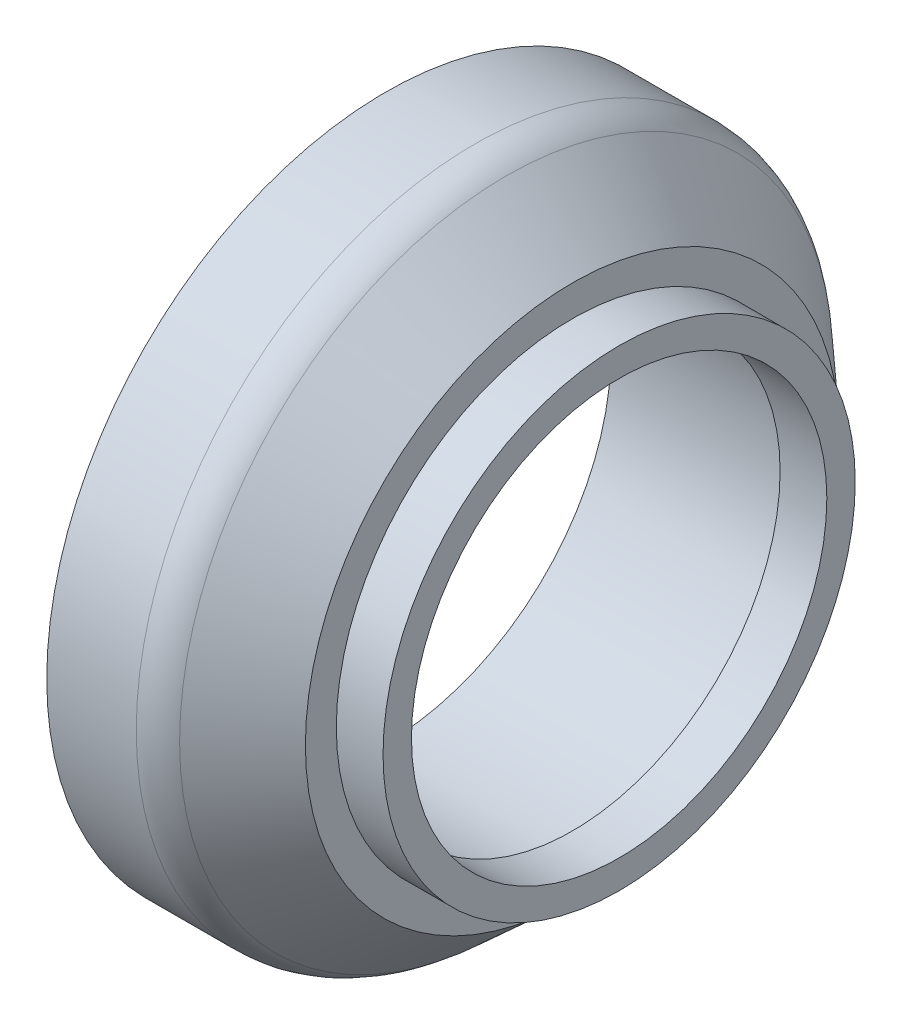
ISO-10303-21;
HEADER;
FILE_DESCRIPTION(('STEP AP214'),'2;1');
FILE_NAME('part.step','',(''),(''),'','','');
FILE_SCHEMA(('AUTOMOTIVE_DESIGN { 1 0 10303 214 1 1 1 1 }'));
ENDSEC;
DATA;
#1=APPLICATION_CONTEXT('core data for automotive mechanical design processes');
#2=APPLICATION_PROTOCOL_DEFINITION('international standard','automotive_design',2000,#1);
#3=PRODUCT_CONTEXT('',#1,'mechanical');
#4=PRODUCT('Part','Part','',(#3));
#5=PRODUCT_RELATED_PRODUCT_CATEGORY('part','',(#4));
#6=PRODUCT_DEFINITION_FORMATION('','',#4);
#7=PRODUCT_DEFINITION_CONTEXT('part definition',#1,'design');
#8=PRODUCT_DEFINITION('design','',#6,#7);
#9=PRODUCT_DEFINITION_SHAPE('','',#8);
#10=(LENGTH_UNIT() NAMED_UNIT(*) SI_UNIT(.MILLI.,.METRE.));
#11=(NAMED_UNIT(*) PLANE_ANGLE_UNIT() SI_UNIT($,.RADIAN.));
#12=(NAMED_UNIT(*) SI_UNIT($,.STERADIAN.) SOLID_ANGLE_UNIT());
#13=UNCERTAINTY_MEASURE_WITH_UNIT(LENGTH_MEASURE(1.E-05),#10,'distance_accuracy_value','');
#14=(GEOMETRIC_REPRESENTATION_CONTEXT(3) GLOBAL_UNCERTAINTY_ASSIGNED_CONTEXT((#13)) GLOBAL_UNIT_ASSIGNED_CONTEXT((#10,
#11,#12)) REPRESENTATION_CONTEXT('',''));
#15=CARTESIAN_POINT('',(0.,0.,0.));
#16=DIRECTION('',(0.,0.,1.));
#17=DIRECTION('',(1.,0.,0.));
#18=AXIS2_PLACEMENT_3D('',#15,#16,#17);
#19=CARTESIAN_POINT('',(0.,72.5,0.));
#20=DIRECTION('',(1.,0.,0.));
#21=DIRECTION('',(0.,0.,-1.));
#22=AXIS2_PLACEMENT_3D('',#19,#20,#21);
#23=PLANE('',#22);
#24=CARTESIAN_POINT('',(0.,53.2469218721899,-32.726370271341));
#25=DIRECTION('',(1.,0.,0.));
#26=DIRECTION('',(0.,0.,-1.));
#27=AXIS2_PLACEMENT_3D('',#24,#25,#26);
#28=CIRCLE('',#27,6.35000000000003);
#29=CARTESIAN_POINT('',(0.,53.2469218721899,-39.076370271341));
#30=VERTEX_POINT('',#29);
#31=EDGE_CURVE('E10',#30,#30,#28,.T.);
#32=ORIENTED_EDGE('',*,*,#31,.T.);
#33=EDGE_LOOP('',(#32));
#34=FACE_BOUND('',#33,.T.);
#35=CARTESIAN_POINT('',(0.,29.7500018789712,-54.9653289647321));
#36=DIRECTION('',(1.,0.,0.));
#37=DIRECTION('',(0.,0.,-1.));
#38=AXIS2_PLACEMENT_3D('',#35,#36,#37);
#39=CIRCLE('',#38,6.35000000000001);
#40=CARTESIAN_POINT('',(0.,29.7500018789712,-61.3153289647321));
#41=VERTEX_POINT('',#40);
#42=EDGE_CURVE('E45',#41,#41,#39,.T.);
#43=ORIENTED_EDGE('',*,*,#42,.T.);
#44=EDGE_LOOP('',(#43));
#45=FACE_BOUND('',#44,.T.);
#46=CARTESIAN_POINT('',(0.,-1.71840709254231,-62.4763721503122));
#47=DIRECTION('',(1.,0.,0.));
#48=DIRECTION('',(0.,0.,-1.));
#49=AXIS2_PLACEMENT_3D('',#46,#47,#48);
#50=CIRCLE('',#49,6.35000000000002);
#51=CARTESIAN_POINT('',(0.,-1.71840709254231,-68.8263721503122));
#52=VERTEX_POINT('',#51);
#53=EDGE_CURVE('E54',#52,#52,#50,.T.);
#54=ORIENTED_EDGE('',*,*,#53,.T.);
#55=EDGE_LOOP('',(#54));
#56=FACE_BOUND('',#55,.T.);
#57=CARTESIAN_POINT('',(0.,-32.7263702713411,-53.2469218721898));
#58=DIRECTION('',(1.,0.,0.));
#59=DIRECTION('',(0.,0.,-1.));
#60=AXIS2_PLACEMENT_3D('',#57,#58,#59);
#61=CIRCLE('',#60,6.34999999999996);
#62=CARTESIAN_POINT('',(0.,-32.7263702713411,-59.5969218721897));
#63=VERTEX_POINT('',#62);
#64=EDGE_CURVE('E60',#63,#63,#61,.T.);
#65=ORIENTED_EDGE('',*,*,#64,.T.);
#66=EDGE_LOOP('',(#65));
#67=FACE_BOUND('',#66,.T.);
#68=CARTESIAN_POINT('',(0.,-54.9653289647322,-29.750001878971));
#69=DIRECTION('',(1.,0.,0.));
#70=DIRECTION('',(0.,0.,-1.));
#71=AXIS2_PLACEMENT_3D('',#68,#69,#70);
#72=CIRCLE('',#71,6.35);
#73=CARTESIAN_POINT('',(0.,-54.9653289647322,-36.100001878971));
#74=VERTEX_POINT('',#73);
#75=EDGE_CURVE('E66',#74,#74,#72,.T.);
#76=ORIENTED_EDGE('',*,*,#75,.T.);
#77=EDGE_LOOP('',(#76));
#78=FACE_BOUND('',#77,.T.);
#79=CARTESIAN_POINT('',(0.,-62.4763721503121,1.71840709254296));
#80=DIRECTION('',(1.,0.,0.));
#81=DIRECTION('',(0.,0.,-1.));
#82=AXIS2_PLACEMENT_3D('',#79,#80,#81);
#83=CIRCLE('',#82,6.35000000000005);
#84=CARTESIAN_POINT('',(0.,-62.4763721503121,-4.63159290745709));
#85=VERTEX_POINT('',#84);
#86=EDGE_CURVE('E72',#85,#85,#83,.T.);
#87=ORIENTED_EDGE('',*,*,#86,.T.);
#88=EDGE_LOOP('',(#87));
#89=FACE_BOUND('',#88,.T.);
#90=CARTESIAN_POINT('',(0.,-53.2469218721896,32.7263702713413));
#91=DIRECTION('',(1.,0.,0.));
#92=DIRECTION('',(0.,0.,-1.));
#93=AXIS2_PLACEMENT_3D('',#90,#91,#92);
#94=CIRCLE('',#93,6.35000000000008);
#95=CARTESIAN_POINT('',(0.,-53.2469218721896,26.3763702713413));
#96=VERTEX_POINT('',#95);
#97=EDGE_CURVE('E78',#96,#96,#94,.T.);
#98=ORIENTED_EDGE('',*,*,#97,.T.);
#99=EDGE_LOOP('',(#98));
#100=FACE_BOUND('',#99,.T.);
#101=CARTESIAN_POINT('',(0.,-29.7500018789708,54.9653289647323));
#102=DIRECTION('',(1.,0.,0.));
#103=DIRECTION('',(0.,0.,-1.));
#104=AXIS2_PLACEMENT_3D('',#101,#102,#103);
#105=CIRCLE('',#104,6.34999999999998);
#106=CARTESIAN_POINT('',(0.,-29.7500018789708,48.6153289647323));
#107=VERTEX_POINT('',#106);
#108=EDGE_CURVE('E84',#107,#107,#105,.T.);
#109=ORIENTED_EDGE('',*,*,#108,.T.);
#110=EDGE_LOOP('',(#109));
#111=FACE_BOUND('',#110,.T.);
#112=CARTESIAN_POINT('',(0.,1.71840709254274,62.4763721503122));
#113=DIRECTION('',(1.,0.,0.));
#114=DIRECTION('',(0.,0.,-1.));
#115=AXIS2_PLACEMENT_3D('',#112,#113,#114);
#116=CIRCLE('',#115,6.35000000000002);
#117=CARTESIAN_POINT('',(0.,1.71840709254274,56.1263721503121));
#118=VERTEX_POINT('',#117);
#119=EDGE_CURVE('E90',#118,#118,#116,.T.);
#120=ORIENTED_EDGE('',*,*,#119,.T.);
#121=EDGE_LOOP('',(#120));
#122=FACE_BOUND('',#121,.T.);
#123=CARTESIAN_POINT('',(0.,32.7263702713415,53.2469218721895));
#124=DIRECTION('',(1.,0.,0.));
#125=DIRECTION('',(0.,0.,-1.));
#126=AXIS2_PLACEMENT_3D('',#123,#124,#125);
#127=CIRCLE('',#126,6.35000000000007);
#128=CARTESIAN_POINT('',(0.,32.7263702713415,46.8969218721895));
#129=VERTEX_POINT('',#128);
#130=EDGE_CURVE('E96',#129,#129,#127,.T.);
#131=ORIENTED_EDGE('',*,*,#130,.T.);
#132=EDGE_LOOP('',(#131));
#133=FACE_BOUND('',#132,.T.);
#134=CARTESIAN_POINT('',(0.,54.9653289647324,29.7500018789706));
#135=DIRECTION('',(1.,0.,0.));
#136=DIRECTION('',(0.,0.,-1.));
#137=AXIS2_PLACEMENT_3D('',#134,#135,#136);
#138=CIRCLE('',#137,6.35000000000004);
#139=CARTESIAN_POINT('',(0.,54.9653289647324,23.4000018789705));
#140=VERTEX_POINT('',#139);
#141=EDGE_CURVE('E102',#140,#140,#138,.T.);
#142=ORIENTED_EDGE('',*,*,#141,.T.);
#143=EDGE_LOOP('',(#142));
#144=FACE_BOUND('',#143,.T.);
#145=CARTESIAN_POINT('',(0.,62.4763721503121,-1.71840709254296));
#146=DIRECTION('',(1.,0.,0.));
#147=DIRECTION('',(0.,0.,-1.));
#148=AXIS2_PLACEMENT_3D('',#145,#146,#147);
#149=CIRCLE('',#148,6.35000000000005);
#150=CARTESIAN_POINT('',(0.,62.4763721503121,-8.06840709254301));
#151=VERTEX_POINT('',#150);
#152=EDGE_CURVE('E108',#151,#151,#149,.T.);
#153=ORIENTED_EDGE('',*,*,#152,.T.);
#154=EDGE_LOOP('',(#153));
#155=FACE_BOUND('',#154,.T.);
#156=CARTESIAN_POINT('',(0.,0.,0.));
#157=DIRECTION('',(-1.,0.,0.));
#158=DIRECTION('',(0.,0.,1.));
#159=AXIS2_PLACEMENT_3D('',#156,#157,#158);
#160=CIRCLE('',#159,48.25);
#161=CARTESIAN_POINT('',(0.,0.,48.25));
#162=VERTEX_POINT('',#161);
#163=EDGE_CURVE('E123',#162,#162,#160,.T.);
#164=ORIENTED_EDGE('',*,*,#163,.F.);
#165=EDGE_LOOP('',(#164));
#166=FACE_BOUND('',#165,.T.);
#167=CARTESIAN_POINT('',(0.,0.,0.));
#168=DIRECTION('',(-1.,0.,0.));
#169=DIRECTION('',(0.,0.,1.));
#170=AXIS2_PLACEMENT_3D('',#167,#168,#169);
#171=CIRCLE('',#170,72.5);
#172=CARTESIAN_POINT('',(0.,0.,72.5));
#173=VERTEX_POINT('',#172);
#174=EDGE_CURVE('E132',#173,#173,#171,.T.);
#175=ORIENTED_EDGE('',*,*,#174,.T.);
#176=EDGE_LOOP('',(#175));
#177=FACE_BOUND('',#176,.T.);
#178=ADVANCED_FACE('F34',(#34,#45,#56,#67,#78,#89,#100,#111,#122,#133,#144,#155,#166,#177),#23,.F.);
#179=CARTESIAN_POINT('',(0.,0.,0.));
#180=DIRECTION('',(-1.,0.,0.));
#181=DIRECTION('',(0.,0.,1.));
#182=AXIS2_PLACEMENT_3D('',#179,#180,#181);
#183=CYLINDRICAL_SURFACE('',#182,48.25);
#184=CARTESIAN_POINT('',(40.,0.,0.));
#185=DIRECTION('',(-1.,0.,0.));
#186=DIRECTION('',(0.,0.,1.));
#187=AXIS2_PLACEMENT_3D('',#184,#185,#186);
#188=CIRCLE('',#187,48.25);
#189=CARTESIAN_POINT('',(40.,0.,48.25));
#190=VERTEX_POINT('',#189);
#191=EDGE_CURVE('E126',#190,#190,#188,.T.);
#192=ORIENTED_EDGE('',*,*,#191,.F.);
#193=EDGE_LOOP('',(#192));
#194=FACE_BOUND('',#193,.T.);
#195=ORIENTED_EDGE('',*,*,#163,.T.);
#196=EDGE_LOOP('',(#195));
#197=FACE_BOUND('',#196,.T.);
#198=ADVANCED_FACE('F198',(#194,#197),#183,.F.);
#199=CARTESIAN_POINT('',(40.,48.25,0.));
#200=DIRECTION('',(-1.,0.,0.));
#201=DIRECTION('',(0.,0.,1.));
#202=AXIS2_PLACEMENT_3D('',#199,#200,#201);
#203=PLANE('',#202);
#204=CARTESIAN_POINT('',(40.,0.,0.));
#205=DIRECTION('',(-1.,0.,0.));
#206=DIRECTION('',(0.,0.,1.));
#207=AXIS2_PLACEMENT_3D('',#204,#205,#206);
#208=CIRCLE('',#207,50.53);
#209=CARTESIAN_POINT('',(40.,0.,50.53));
#210=VERTEX_POINT('',#209);
#211=EDGE_CURVE('E114',#210,#210,#208,.F.);
#212=ORIENTED_EDGE('',*,*,#211,.F.);
#213=EDGE_LOOP('',(#212));
#214=FACE_BOUND('',#213,.T.);
#215=CARTESIAN_POINT('',(40.,0.,0.));
#216=DIRECTION('',(-1.,0.,0.));
#217=DIRECTION('',(0.,0.,1.));
#218=AXIS2_PLACEMENT_3D('',#215,#216,#217);
#219=CIRCLE('',#218,57.15);
#220=CARTESIAN_POINT('',(40.,0.,57.15));
#221=VERTEX_POINT('',#220);
#222=EDGE_CURVE('E129',#221,#221,#219,.T.);
#223=ORIENTED_EDGE('',*,*,#222,.F.);
#224=EDGE_LOOP('',(#223));
#225=FACE_BOUND('',#224,.T.);
#226=ADVANCED_FACE('F203',(#214,#225),#203,.F.);
#227=CARTESIAN_POINT('',(40.,0.,0.));
#228=DIRECTION('',(-1.,0.,0.));
#229=DIRECTION('',(0.,0.,1.));
#230=AXIS2_PLACEMENT_3D('',#227,#228,#229);
#231=CONICAL_SURFACE('',#230,57.15,0.73443768676526);
#232=CARTESIAN_POINT('',(25.8550285509689,0.,0.));
#233=DIRECTION('',(1.,0.,0.));
#234=DIRECTION('',(0.,0.,-1.));
#235=AXIS2_PLACEMENT_3D('',#232,#233,#234);
#236=CIRCLE('',#235,69.922077161331);
#237=CARTESIAN_POINT('',(25.8550285509689,0.,-69.922077161331));
#238=VERTEX_POINT('',#237);
#239=EDGE_CURVE('E117',#238,#238,#236,.T.);
#240=ORIENTED_EDGE('',*,*,#239,.T.);
#241=EDGE_LOOP('',(#240));
#242=FACE_BOUND('',#241,.T.);
#243=ORIENTED_EDGE('',*,*,#222,.T.);
#244=EDGE_LOOP('',(#243));
#245=FACE_BOUND('',#244,.T.);
#246=ADVANCED_FACE('F293',(#242,#245),#231,.T.);
#247=CARTESIAN_POINT('',(0.,0.,0.));
#248=DIRECTION('',(-1.,0.,0.));
#249=DIRECTION('',(0.,0.,1.));
#250=AXIS2_PLACEMENT_3D('',#247,#248,#249);
#251=CYLINDRICAL_SURFACE('',#250,72.5);
#252=CARTESIAN_POINT('',(19.1533294670613,0.,0.));
#253=DIRECTION('',(1.,0.,0.));
#254=DIRECTION('',(0.,0.,-1.));
#255=AXIS2_PLACEMENT_3D('',#252,#253,#254);
#256=CIRCLE('',#255,72.5);
#257=CARTESIAN_POINT('',(19.1533294670613,0.,-72.5));
#258=VERTEX_POINT('',#257);
#259=EDGE_CURVE('E120',#258,#258,#256,.F.);
#260=ORIENTED_EDGE('',*,*,#259,.T.);
#261=EDGE_LOOP('',(#260));
#262=FACE_BOUND('',#261,.T.);
#263=ORIENTED_EDGE('',*,*,#174,.F.);
#264=EDGE_LOOP('',(#263));
#265=FACE_BOUND('',#264,.T.);
#266=ADVANCED_FACE('F213',(#262,#265),#251,.T.);
#267=CARTESIAN_POINT('',(19.1533294670613,0.,0.));
#268=DIRECTION('',(1.,0.,0.));
#269=DIRECTION('',(0.,0.,-1.));
#270=AXIS2_PLACEMENT_3D('',#267,#268,#269);
#271=TOROIDAL_SURFACE('',#270,62.5,10.);
#272=ORIENTED_EDGE('',*,*,#239,.F.);
#273=EDGE_LOOP('',(#272));
#274=FACE_BOUND('',#273,.T.);
#275=ORIENTED_EDGE('',*,*,#259,.F.);
#276=EDGE_LOOP('',(#275));
#277=FACE_BOUND('',#276,.T.);
#278=ADVANCED_FACE('F209',(#274,#277),#271,.T.);
#279=CARTESIAN_POINT('',(40.,0.,0.));
#280=DIRECTION('',(1.,0.,0.));
#281=DIRECTION('',(0.,0.,-1.));
#282=AXIS2_PLACEMENT_3D('',#279,#280,#281);
#283=PLANE('',#282);
#284=CARTESIAN_POINT('',(40.,0.,0.));
#285=DIRECTION('',(1.,0.,0.));
#286=DIRECTION('',(0.,0.,-1.));
#287=AXIS2_PLACEMENT_3D('',#284,#285,#286);
#288=CIRCLE('',#287,44.45);
#289=CARTESIAN_POINT('',(40.,0.,-44.45));
#290=VERTEX_POINT('',#289);
#291=EDGE_CURVE('E139',#290,#290,#288,.T.);
#292=ORIENTED_EDGE('',*,*,#291,.T.);
#293=EDGE_LOOP('',(#292));
#294=FACE_BOUND('',#293,.T.);
#295=ORIENTED_EDGE('',*,*,#191,.T.);
#296=EDGE_LOOP('',(#295));
#297=FACE_BOUND('',#296,.T.);
#298=ADVANCED_FACE('F212',(#294,#297),#283,.F.);
#299=CARTESIAN_POINT('',(50.,0.,0.));
#300=DIRECTION('',(1.,0.,0.));
#301=DIRECTION('',(0.,0.,-1.));
#302=AXIS2_PLACEMENT_3D('',#299,#300,#301);
#303=PLANE('',#302);
#304=CARTESIAN_POINT('',(50.,0.,0.));
#305=DIRECTION('',(1.,0.,0.));
#306=DIRECTION('',(0.,0.,-1.));
#307=AXIS2_PLACEMENT_3D('',#304,#305,#306);
#308=CIRCLE('',#307,50.53);
#309=CARTESIAN_POINT('',(50.,0.,-50.53));
#310=VERTEX_POINT('',#309);
#311=EDGE_CURVE('E135',#310,#310,#308,.T.);
#312=ORIENTED_EDGE('',*,*,#311,.T.);
#313=EDGE_LOOP('',(#312));
#314=FACE_BOUND('',#313,.T.);
#315=CARTESIAN_POINT('',(50.,0.,0.));
#316=DIRECTION('',(1.,0.,0.));
#317=DIRECTION('',(0.,0.,-1.));
#318=AXIS2_PLACEMENT_3D('',#315,#316,#317);
#319=CIRCLE('',#318,44.45);
#320=CARTESIAN_POINT('',(50.,0.,-44.45));
#321=VERTEX_POINT('',#320);
#322=EDGE_CURVE('E138',#321,#321,#319,.T.);
#323=ORIENTED_EDGE('',*,*,#322,.F.);
#324=EDGE_LOOP('',(#323));
#325=FACE_BOUND('',#324,.T.);
#326=ADVANCED_FACE('F315',(#314,#325),#303,.T.);
#327=CARTESIAN_POINT('',(50.,0.,0.));
#328=DIRECTION('',(-1.,0.,0.));
#329=DIRECTION('',(0.,0.,1.));
#330=AXIS2_PLACEMENT_3D('',#327,#328,#329);
#331=CYLINDRICAL_SURFACE('',#330,50.53);
#332=ORIENTED_EDGE('',*,*,#311,.F.);
#333=EDGE_LOOP('',(#332));
#334=FACE_BOUND('',#333,.T.);
#335=ORIENTED_EDGE('',*,*,#211,.T.);
#336=EDGE_LOOP('',(#335));
#337=FACE_BOUND('',#336,.T.);
#338=ADVANCED_FACE('F302',(#334,#337),#331,.T.);
#339=CARTESIAN_POINT('',(50.,0.,0.));
#340=DIRECTION('',(-1.,0.,0.));
#341=DIRECTION('',(0.,0.,1.));
#342=AXIS2_PLACEMENT_3D('',#339,#340,#341);
#343=CYLINDRICAL_SURFACE('',#342,44.45);
#344=ORIENTED_EDGE('',*,*,#322,.T.);
#345=EDGE_LOOP('',(#344));
#346=FACE_BOUND('',#345,.T.);
#347=ORIENTED_EDGE('',*,*,#291,.F.);
#348=EDGE_LOOP('',(#347));
#349=FACE_BOUND('',#348,.T.);
#350=ADVANCED_FACE('F314',(#346,#349),#343,.F.);
#351=CARTESIAN_POINT('',(19.4,62.4763721503121,-1.71840709254296));
#352=DIRECTION('',(-1.,0.,0.));
#353=DIRECTION('',(0.,0.,1.));
#354=AXIS2_PLACEMENT_3D('',#351,#352,#353);
#355=CYLINDRICAL_SURFACE('',#354,5.35);
#356=CARTESIAN_POINT('',(1.00000000000004,62.4763721503121,-1.71840709254296));
#357=DIRECTION('',(1.,0.,0.));
#358=DIRECTION('',(0.,0.,-1.));
#359=AXIS2_PLACEMENT_3D('',#356,#357,#358);
#360=CIRCLE('',#359,5.35);
#361=CARTESIAN_POINT('',(1.00000000000004,62.4763721503121,-7.06840709254296));
#362=VERTEX_POINT('',#361);
#363=EDGE_CURVE('E111',#362,#362,#360,.F.);
#364=ORIENTED_EDGE('',*,*,#363,.T.);
#365=EDGE_LOOP('',(#364));
#366=FACE_BOUND('',#365,.T.);
#367=CARTESIAN_POINT('',(19.4,62.4763721503121,-1.71840709254296));
#368=DIRECTION('',(-1.,0.,0.));
#369=DIRECTION('',(0.,0.,1.));
#370=AXIS2_PLACEMENT_3D('',#367,#368,#369);
#371=CIRCLE('',#370,5.35);
#372=CARTESIAN_POINT('',(19.4,62.4763721503121,3.63159290745704));
#373=VERTEX_POINT('',#372);
#374=EDGE_CURVE('E142',#373,#373,#371,.T.);
#375=ORIENTED_EDGE('',*,*,#374,.F.);
#376=EDGE_LOOP('',(#375));
#377=FACE_BOUND('',#376,.T.);
#378=ADVANCED_FACE('F321',(#366,#377),#355,.F.);
#379=CARTESIAN_POINT('',(19.4,62.4763721503121,-1.71840709254296));
#380=DIRECTION('',(-1.,0.,0.));
#381=DIRECTION('',(0.,0.,1.));
#382=AXIS2_PLACEMENT_3D('',#379,#380,#381);
#383=PLANE('',#382);
#384=ORIENTED_EDGE('',*,*,#374,.T.);
#385=EDGE_LOOP('',(#384));
#386=FACE_BOUND('',#385,.T.);
#387=ADVANCED_FACE('F219',(#386),#383,.T.);
#388=CARTESIAN_POINT('',(1.00000000000004,62.4763721503121,-1.71840709254296));
#389=DIRECTION('',(-1.,0.,0.));
#390=DIRECTION('',(0.,0.,1.));
#391=AXIS2_PLACEMENT_3D('',#388,#389,#390);
#392=CONICAL_SURFACE('',#391,5.35,0.785398163397454);
#393=ORIENTED_EDGE('',*,*,#152,.F.);
#394=EDGE_LOOP('',(#393));
#395=FACE_BOUND('',#394,.T.);
#396=ORIENTED_EDGE('',*,*,#363,.F.);
#397=EDGE_LOOP('',(#396));
#398=FACE_BOUND('',#397,.T.);
#399=ADVANCED_FACE('F215',(#395,#398),#392,.F.);
#400=CARTESIAN_POINT('',(19.4,54.9653289647324,29.7500018789706));
#401=DIRECTION('',(-1.,0.,0.));
#402=DIRECTION('',(0.,0.,1.));
#403=AXIS2_PLACEMENT_3D('',#400,#401,#402);
#404=CYLINDRICAL_SURFACE('',#403,5.35);
#405=CARTESIAN_POINT('',(1.00000000000004,54.9653289647324,29.7500018789706));
#406=DIRECTION('',(1.,0.,0.));
#407=DIRECTION('',(0.,0.,-1.));
#408=AXIS2_PLACEMENT_3D('',#405,#406,#407);
#409=CIRCLE('',#408,5.35);
#410=CARTESIAN_POINT('',(1.00000000000004,54.9653289647324,24.4000018789706));
#411=VERTEX_POINT('',#410);
#412=EDGE_CURVE('E105',#411,#411,#409,.F.);
#413=ORIENTED_EDGE('',*,*,#412,.T.);
#414=EDGE_LOOP('',(#413));
#415=FACE_BOUND('',#414,.T.);
#416=CARTESIAN_POINT('',(19.4,54.9653289647324,29.7500018789706));
#417=DIRECTION('',(-1.,0.,0.));
#418=DIRECTION('',(0.,-0.500000000000001,0.866025403784438));
#419=AXIS2_PLACEMENT_3D('',#416,#417,#418);
#420=CIRCLE('',#419,5.35);
#421=CARTESIAN_POINT('',(19.4,52.2903289647324,34.3832377892173));
#422=VERTEX_POINT('',#421);
#423=EDGE_CURVE('E147',#422,#422,#420,.T.);
#424=ORIENTED_EDGE('',*,*,#423,.F.);
#425=EDGE_LOOP('',(#424));
#426=FACE_BOUND('',#425,.T.);
#427=ADVANCED_FACE('F218',(#415,#426),#404,.F.);
#428=CARTESIAN_POINT('',(19.4,54.9653289647324,29.7500018789706));
#429=DIRECTION('',(-1.,0.,0.));
#430=DIRECTION('',(0.,-0.500000000000001,0.866025403784438));
#431=AXIS2_PLACEMENT_3D('',#428,#429,#430);
#432=PLANE('',#431);
#433=ORIENTED_EDGE('',*,*,#423,.T.);
#434=EDGE_LOOP('',(#433));
#435=FACE_BOUND('',#434,.T.);
#436=ADVANCED_FACE('F347',(#435),#432,.T.);
#437=CARTESIAN_POINT('',(19.4,53.2469218721899,-32.726370271341));
#438=DIRECTION('',(-1.,0.,0.));
#439=DIRECTION('',(0.,0.,1.));
#440=AXIS2_PLACEMENT_3D('',#437,#438,#439);
#441=CYLINDRICAL_SURFACE('',#440,5.35);
#442=CARTESIAN_POINT('',(0.999999999999984,53.2469218721899,-32.726370271341));
#443=DIRECTION('',(1.,0.,0.));
#444=DIRECTION('',(0.,0.,-1.));
#445=AXIS2_PLACEMENT_3D('',#442,#443,#444);
#446=CIRCLE('',#445,5.35);
#447=CARTESIAN_POINT('',(0.999999999999984,53.2469218721899,-38.076370271341));
#448=VERTEX_POINT('',#447);
#449=EDGE_CURVE('E41',#448,#448,#446,.F.);
#450=ORIENTED_EDGE('',*,*,#449,.T.);
#451=EDGE_LOOP('',(#450));
#452=FACE_BOUND('',#451,.T.);
#453=CARTESIAN_POINT('',(19.4,53.2469218721899,-32.726370271341));
#454=DIRECTION('',(-1.,0.,0.));
#455=DIRECTION('',(0.,0.499999999999989,0.866025403784445));
#456=AXIS2_PLACEMENT_3D('',#453,#454,#455);
#457=CIRCLE('',#456,5.35);
#458=CARTESIAN_POINT('',(19.4,55.9219218721898,-28.0931343610942));
#459=VERTEX_POINT('',#458);
#460=EDGE_CURVE('E175',#459,#459,#457,.T.);
#461=ORIENTED_EDGE('',*,*,#460,.F.);
#462=EDGE_LOOP('',(#461));
#463=FACE_BOUND('',#462,.T.);
#464=ADVANCED_FACE('F194',(#452,#463),#441,.F.);
#465=CARTESIAN_POINT('',(19.4,53.2469218721899,-32.726370271341));
#466=DIRECTION('',(-1.,0.,0.));
#467=DIRECTION('',(0.,0.499999999999989,0.866025403784445));
#468=AXIS2_PLACEMENT_3D('',#465,#466,#467);
#469=PLANE('',#468);
#470=ORIENTED_EDGE('',*,*,#460,.T.);
#471=EDGE_LOOP('',(#470));
#472=FACE_BOUND('',#471,.T.);
#473=ADVANCED_FACE('F185',(#472),#469,.T.);
#474=CARTESIAN_POINT('',(19.4,29.7500018789712,-54.9653289647321));
#475=DIRECTION('',(-1.,0.,0.));
#476=DIRECTION('',(0.,0.,1.));
#477=AXIS2_PLACEMENT_3D('',#474,#475,#476);
#478=CYLINDRICAL_SURFACE('',#477,5.35);
#479=CARTESIAN_POINT('',(1.00000000000001,29.7500018789712,-54.9653289647321));
#480=DIRECTION('',(1.,0.,0.));
#481=DIRECTION('',(0.,0.,-1.));
#482=AXIS2_PLACEMENT_3D('',#479,#480,#481);
#483=CIRCLE('',#482,5.35);
#484=CARTESIAN_POINT('',(1.00000000000001,29.7500018789712,-60.3153289647321));
#485=VERTEX_POINT('',#484);
#486=EDGE_CURVE('E49',#485,#485,#483,.F.);
#487=ORIENTED_EDGE('',*,*,#486,.T.);
#488=EDGE_LOOP('',(#487));
#489=FACE_BOUND('',#488,.T.);
#490=CARTESIAN_POINT('',(19.4,29.7500018789712,-54.9653289647321));
#491=DIRECTION('',(-1.,0.,0.));
#492=DIRECTION('',(0.,0.866025403784433,0.50000000000001));
#493=AXIS2_PLACEMENT_3D('',#490,#491,#492);
#494=CIRCLE('',#493,5.35);
#495=CARTESIAN_POINT('',(19.4,34.3832377892179,-52.290328964732));
#496=VERTEX_POINT('',#495);
#497=EDGE_CURVE('E155',#496,#496,#494,.T.);
#498=ORIENTED_EDGE('',*,*,#497,.F.);
#499=EDGE_LOOP('',(#498));
#500=FACE_BOUND('',#499,.T.);
#501=ADVANCED_FACE('F183',(#489,#500),#478,.F.);
#502=CARTESIAN_POINT('',(19.4,29.7500018789712,-54.9653289647321));
#503=DIRECTION('',(-1.,0.,0.));
#504=DIRECTION('',(0.,0.866025403784433,0.50000000000001));
#505=AXIS2_PLACEMENT_3D('',#502,#503,#504);
#506=PLANE('',#505);
#507=ORIENTED_EDGE('',*,*,#497,.T.);
#508=EDGE_LOOP('',(#507));
#509=FACE_BOUND('',#508,.T.);
#510=ADVANCED_FACE('F181',(#509),#506,.T.);
#511=CARTESIAN_POINT('',(19.4,-1.71840709254231,-62.4763721503122));
#512=DIRECTION('',(-1.,0.,0.));
#513=DIRECTION('',(0.,0.,1.));
#514=AXIS2_PLACEMENT_3D('',#511,#512,#513);
#515=CYLINDRICAL_SURFACE('',#514,5.35);
#516=CARTESIAN_POINT('',(0.99999999999998,-1.71840709254231,-62.4763721503122));
#517=DIRECTION('',(1.,0.,0.));
#518=DIRECTION('',(0.,0.,-1.));
#519=AXIS2_PLACEMENT_3D('',#516,#517,#518);
#520=CIRCLE('',#519,5.35);
#521=CARTESIAN_POINT('',(0.99999999999998,-1.71840709254231,-67.8263721503122));
#522=VERTEX_POINT('',#521);
#523=EDGE_CURVE('E57',#522,#522,#520,.F.);
#524=ORIENTED_EDGE('',*,*,#523,.T.);
#525=EDGE_LOOP('',(#524));
#526=FACE_BOUND('',#525,.T.);
#527=CARTESIAN_POINT('',(19.4,-1.71840709254231,-62.4763721503122));
#528=DIRECTION('',(-1.,0.,0.));
#529=DIRECTION('',(0.,1.,0.));
#530=AXIS2_PLACEMENT_3D('',#527,#528,#529);
#531=CIRCLE('',#530,5.35);
#532=CARTESIAN_POINT('',(19.4,3.63159290745769,-62.4763721503121));
#533=VERTEX_POINT('',#532);
#534=EDGE_CURVE('E151',#533,#533,#531,.T.);
#535=ORIENTED_EDGE('',*,*,#534,.F.);
#536=EDGE_LOOP('',(#535));
#537=FACE_BOUND('',#536,.T.);
#538=ADVANCED_FACE('F192',(#526,#537),#515,.F.);
#539=CARTESIAN_POINT('',(19.4,-1.71840709254231,-62.4763721503122));
#540=DIRECTION('',(-1.,0.,0.));
#541=DIRECTION('',(0.,1.,0.));
#542=AXIS2_PLACEMENT_3D('',#539,#540,#541);
#543=PLANE('',#542);
#544=ORIENTED_EDGE('',*,*,#534,.T.);
#545=EDGE_LOOP('',(#544));
#546=FACE_BOUND('',#545,.T.);
#547=ADVANCED_FACE('F354',(#546),#543,.T.);
#548=CARTESIAN_POINT('',(19.4,-32.7263702713411,-53.2469218721898));
#549=DIRECTION('',(-1.,0.,0.));
#550=DIRECTION('',(0.,0.,1.));
#551=AXIS2_PLACEMENT_3D('',#548,#549,#550);
#552=CYLINDRICAL_SURFACE('',#551,5.35);
#553=CARTESIAN_POINT('',(0.999999999999956,-32.7263702713411,-53.2469218721898));
#554=DIRECTION('',(1.,0.,0.));
#555=DIRECTION('',(0.,0.,-1.));
#556=AXIS2_PLACEMENT_3D('',#553,#554,#555);
#557=CIRCLE('',#556,5.35);
#558=CARTESIAN_POINT('',(0.999999999999956,-32.7263702713411,-58.5969218721898));
#559=VERTEX_POINT('',#558);
#560=EDGE_CURVE('E63',#559,#559,#557,.F.);
#561=ORIENTED_EDGE('',*,*,#560,.T.);
#562=EDGE_LOOP('',(#561));
#563=FACE_BOUND('',#562,.T.);
#564=CARTESIAN_POINT('',(19.4,-32.7263702713411,-53.2469218721898));
#565=DIRECTION('',(-1.,0.,0.));
#566=DIRECTION('',(0.,0.866025403784443,-0.499999999999992));
#567=AXIS2_PLACEMENT_3D('',#564,#565,#566);
#568=CIRCLE('',#567,5.35);
#569=CARTESIAN_POINT('',(19.4,-28.0931343610944,-55.9219218721897));
#570=VERTEX_POINT('',#569);
#571=EDGE_CURVE('E154',#570,#570,#568,.T.);
#572=ORIENTED_EDGE('',*,*,#571,.F.);
#573=EDGE_LOOP('',(#572));
#574=FACE_BOUND('',#573,.T.);
#575=ADVANCED_FACE('F358',(#563,#574),#552,.F.);
#576=CARTESIAN_POINT('',(19.4,-32.7263702713411,-53.2469218721898));
#577=DIRECTION('',(-1.,0.,0.));
#578=DIRECTION('',(0.,0.866025403784443,-0.499999999999992));
#579=AXIS2_PLACEMENT_3D('',#576,#577,#578);
#580=PLANE('',#579);
#581=ORIENTED_EDGE('',*,*,#571,.T.);
#582=EDGE_LOOP('',(#581));
#583=FACE_BOUND('',#582,.T.);
#584=ADVANCED_FACE('F362',(#583),#580,.T.);
#585=CARTESIAN_POINT('',(19.4,-54.9653289647322,-29.750001878971));
#586=DIRECTION('',(-1.,0.,0.));
#587=DIRECTION('',(0.,0.,1.));
#588=AXIS2_PLACEMENT_3D('',#585,#586,#587);
#589=CYLINDRICAL_SURFACE('',#588,5.35);
#590=CARTESIAN_POINT('',(0.99999999999998,-54.9653289647322,-29.750001878971));
#591=DIRECTION('',(1.,0.,0.));
#592=DIRECTION('',(0.,0.,-1.));
#593=AXIS2_PLACEMENT_3D('',#590,#591,#592);
#594=CIRCLE('',#593,5.35);
#595=CARTESIAN_POINT('',(0.99999999999998,-54.9653289647322,-35.100001878971));
#596=VERTEX_POINT('',#595);
#597=EDGE_CURVE('E69',#596,#596,#594,.F.);
#598=ORIENTED_EDGE('',*,*,#597,.T.);
#599=EDGE_LOOP('',(#598));
#600=FACE_BOUND('',#599,.T.);
#601=CARTESIAN_POINT('',(19.4,-54.9653289647322,-29.750001878971));
#602=DIRECTION('',(-1.,0.,0.));
#603=DIRECTION('',(0.,0.500000000000007,-0.866025403784435));
#604=AXIS2_PLACEMENT_3D('',#601,#602,#603);
#605=CIRCLE('',#604,5.35);
#606=CARTESIAN_POINT('',(19.4,-52.2903289647321,-34.3832377892177));
#607=VERTEX_POINT('',#606);
#608=EDGE_CURVE('E158',#607,#607,#605,.T.);
#609=ORIENTED_EDGE('',*,*,#608,.F.);
#610=EDGE_LOOP('',(#609));
#611=FACE_BOUND('',#610,.T.);
#612=ADVANCED_FACE('F366',(#600,#611),#589,.F.);
#613=CARTESIAN_POINT('',(19.4,-54.9653289647322,-29.750001878971));
#614=DIRECTION('',(-1.,0.,0.));
#615=DIRECTION('',(0.,0.500000000000007,-0.866025403784435));
#616=AXIS2_PLACEMENT_3D('',#613,#614,#615);
#617=PLANE('',#616);
#618=ORIENTED_EDGE('',*,*,#608,.T.);
#619=EDGE_LOOP('',(#618));
#620=FACE_BOUND('',#619,.T.);
#621=ADVANCED_FACE('F370',(#620),#617,.T.);
#622=CARTESIAN_POINT('',(19.4,-62.4763721503121,1.71840709254296));
#623=DIRECTION('',(-1.,0.,0.));
#624=DIRECTION('',(0.,0.,1.));
#625=AXIS2_PLACEMENT_3D('',#622,#623,#624);
#626=CYLINDRICAL_SURFACE('',#625,5.35);
#627=CARTESIAN_POINT('',(1.00000000000004,-62.4763721503121,1.71840709254296));
#628=DIRECTION('',(1.,0.,0.));
#629=DIRECTION('',(0.,0.,-1.));
#630=AXIS2_PLACEMENT_3D('',#627,#628,#629);
#631=CIRCLE('',#630,5.35);
#632=CARTESIAN_POINT('',(1.00000000000004,-62.4763721503121,-3.63159290745704));
#633=VERTEX_POINT('',#632);
#634=EDGE_CURVE('E75',#633,#633,#631,.F.);
#635=ORIENTED_EDGE('',*,*,#634,.T.);
#636=EDGE_LOOP('',(#635));
#637=FACE_BOUND('',#636,.T.);
#638=CARTESIAN_POINT('',(19.4,-62.4763721503121,1.71840709254296));
#639=DIRECTION('',(-1.,0.,0.));
#640=DIRECTION('',(0.,0.,-1.));
#641=AXIS2_PLACEMENT_3D('',#638,#639,#640);
#642=CIRCLE('',#641,5.35);
#643=CARTESIAN_POINT('',(19.4,-62.4763721503121,-3.63159290745704));
#644=VERTEX_POINT('',#643);
#645=EDGE_CURVE('E161',#644,#644,#642,.T.);
#646=ORIENTED_EDGE('',*,*,#645,.F.);
#647=EDGE_LOOP('',(#646));
#648=FACE_BOUND('',#647,.T.);
#649=ADVANCED_FACE('F374',(#637,#648),#626,.F.);
#650=CARTESIAN_POINT('',(19.4,-62.4763721503121,1.71840709254296));
#651=DIRECTION('',(-1.,0.,0.));
#652=DIRECTION('',(0.,0.,-1.));
#653=AXIS2_PLACEMENT_3D('',#650,#651,#652);
#654=PLANE('',#653);
#655=ORIENTED_EDGE('',*,*,#645,.T.);
#656=EDGE_LOOP('',(#655));
#657=FACE_BOUND('',#656,.T.);
#658=ADVANCED_FACE('F378',(#657),#654,.T.);
#659=CARTESIAN_POINT('',(19.4,-53.2469218721896,32.7263702713413));
#660=DIRECTION('',(-1.,0.,0.));
#661=DIRECTION('',(0.,0.,1.));
#662=AXIS2_PLACEMENT_3D('',#659,#660,#661);
#663=CYLINDRICAL_SURFACE('',#662,5.35);
#664=CARTESIAN_POINT('',(1.00000000000004,-53.2469218721896,32.7263702713413));
#665=DIRECTION('',(1.,0.,0.));
#666=DIRECTION('',(0.,0.,-1.));
#667=AXIS2_PLACEMENT_3D('',#664,#665,#666);
#668=CIRCLE('',#667,5.35);
#669=CARTESIAN_POINT('',(1.00000000000004,-53.2469218721896,27.3763702713413));
#670=VERTEX_POINT('',#669);
#671=EDGE_CURVE('E81',#670,#670,#668,.F.);
#672=ORIENTED_EDGE('',*,*,#671,.T.);
#673=EDGE_LOOP('',(#672));
#674=FACE_BOUND('',#673,.T.);
#675=CARTESIAN_POINT('',(19.4,-53.2469218721896,32.7263702713413));
#676=DIRECTION('',(-1.,0.,0.));
#677=DIRECTION('',(0.,-0.499999999999995,-0.866025403784442));
#678=AXIS2_PLACEMENT_3D('',#675,#676,#677);
#679=CIRCLE('',#678,5.35);
#680=CARTESIAN_POINT('',(19.4,-55.9219218721896,28.0931343610946));
#681=VERTEX_POINT('',#680);
#682=EDGE_CURVE('E164',#681,#681,#679,.T.);
#683=ORIENTED_EDGE('',*,*,#682,.F.);
#684=EDGE_LOOP('',(#683));
#685=FACE_BOUND('',#684,.T.);
#686=ADVANCED_FACE('F382',(#674,#685),#663,.F.);
#687=CARTESIAN_POINT('',(19.4,-53.2469218721896,32.7263702713413));
#688=DIRECTION('',(-1.,0.,0.));
#689=DIRECTION('',(0.,-0.499999999999995,-0.866025403784442));
#690=AXIS2_PLACEMENT_3D('',#687,#688,#689);
#691=PLANE('',#690);
#692=ORIENTED_EDGE('',*,*,#682,.T.);
#693=EDGE_LOOP('',(#692));
#694=FACE_BOUND('',#693,.T.);
#695=ADVANCED_FACE('F386',(#694),#691,.T.);
#696=CARTESIAN_POINT('',(19.4,-29.7500018789708,54.9653289647323));
#697=DIRECTION('',(-1.,0.,0.));
#698=DIRECTION('',(0.,0.,1.));
#699=AXIS2_PLACEMENT_3D('',#696,#697,#698);
#700=CYLINDRICAL_SURFACE('',#699,5.35);
#701=CARTESIAN_POINT('',(0.999999999999956,-29.7500018789708,54.9653289647323));
#702=DIRECTION('',(1.,0.,0.));
#703=DIRECTION('',(0.,0.,-1.));
#704=AXIS2_PLACEMENT_3D('',#701,#702,#703);
#705=CIRCLE('',#704,5.35);
#706=CARTESIAN_POINT('',(0.999999999999956,-29.7500018789708,49.6153289647323));
#707=VERTEX_POINT('',#706);
#708=EDGE_CURVE('E87',#707,#707,#705,.F.);
#709=ORIENTED_EDGE('',*,*,#708,.T.);
#710=EDGE_LOOP('',(#709));
#711=FACE_BOUND('',#710,.T.);
#712=CARTESIAN_POINT('',(19.4,-29.7500018789708,54.9653289647323));
#713=DIRECTION('',(-1.,0.,0.));
#714=DIRECTION('',(0.,-0.866025403784436,-0.500000000000004));
#715=AXIS2_PLACEMENT_3D('',#712,#713,#714);
#716=CIRCLE('',#715,5.35);
#717=CARTESIAN_POINT('',(19.4,-34.3832377892175,52.2903289647323));
#718=VERTEX_POINT('',#717);
#719=EDGE_CURVE('E167',#718,#718,#716,.T.);
#720=ORIENTED_EDGE('',*,*,#719,.F.);
#721=EDGE_LOOP('',(#720));
#722=FACE_BOUND('',#721,.T.);
#723=ADVANCED_FACE('F390',(#711,#722),#700,.F.);
#724=CARTESIAN_POINT('',(19.4,-29.7500018789708,54.9653289647323));
#725=DIRECTION('',(-1.,0.,0.));
#726=DIRECTION('',(0.,-0.866025403784436,-0.500000000000004));
#727=AXIS2_PLACEMENT_3D('',#724,#725,#726);
#728=PLANE('',#727);
#729=ORIENTED_EDGE('',*,*,#719,.T.);
#730=EDGE_LOOP('',(#729));
#731=FACE_BOUND('',#730,.T.);
#732=ADVANCED_FACE('F394',(#731),#728,.T.);
#733=CARTESIAN_POINT('',(19.4,1.71840709254274,62.4763721503122));
#734=DIRECTION('',(-1.,0.,0.));
#735=DIRECTION('',(0.,0.,1.));
#736=AXIS2_PLACEMENT_3D('',#733,#734,#735);
#737=CYLINDRICAL_SURFACE('',#736,5.35);
#738=CARTESIAN_POINT('',(0.99999999999998,1.71840709254274,62.4763721503122));
#739=DIRECTION('',(1.,0.,0.));
#740=DIRECTION('',(0.,0.,-1.));
#741=AXIS2_PLACEMENT_3D('',#738,#739,#740);
#742=CIRCLE('',#741,5.35);
#743=CARTESIAN_POINT('',(0.99999999999998,1.71840709254274,57.1263721503122));
#744=VERTEX_POINT('',#743);
#745=EDGE_CURVE('E93',#744,#744,#742,.F.);
#746=ORIENTED_EDGE('',*,*,#745,.T.);
#747=EDGE_LOOP('',(#746));
#748=FACE_BOUND('',#747,.T.);
#749=CARTESIAN_POINT('',(19.4,1.71840709254274,62.4763721503122));
#750=DIRECTION('',(-1.,0.,0.));
#751=DIRECTION('',(0.,-1.,0.));
#752=AXIS2_PLACEMENT_3D('',#749,#750,#751);
#753=CIRCLE('',#752,5.35);
#754=CARTESIAN_POINT('',(19.4,-3.63159290745725,62.4763721503121));
#755=VERTEX_POINT('',#754);
#756=EDGE_CURVE('E170',#755,#755,#753,.T.);
#757=ORIENTED_EDGE('',*,*,#756,.F.);
#758=EDGE_LOOP('',(#757));
#759=FACE_BOUND('',#758,.T.);
#760=ADVANCED_FACE('F398',(#748,#759),#737,.F.);
#761=CARTESIAN_POINT('',(19.4,1.71840709254274,62.4763721503122));
#762=DIRECTION('',(-1.,0.,0.));
#763=DIRECTION('',(0.,-1.,0.));
#764=AXIS2_PLACEMENT_3D('',#761,#762,#763);
#765=PLANE('',#764);
#766=ORIENTED_EDGE('',*,*,#756,.T.);
#767=EDGE_LOOP('',(#766));
#768=FACE_BOUND('',#767,.T.);
#769=ADVANCED_FACE('F402',(#768),#765,.T.);
#770=CARTESIAN_POINT('',(19.4,32.7263702713415,53.2469218721895));
#771=DIRECTION('',(-1.,0.,0.));
#772=DIRECTION('',(0.,0.,1.));
#773=AXIS2_PLACEMENT_3D('',#770,#771,#772);
#774=CYLINDRICAL_SURFACE('',#773,5.35);
#775=CARTESIAN_POINT('',(1.00000000000004,32.7263702713415,53.2469218721895));
#776=DIRECTION('',(1.,0.,0.));
#777=DIRECTION('',(0.,0.,-1.));
#778=AXIS2_PLACEMENT_3D('',#775,#776,#777);
#779=CIRCLE('',#778,5.35);
#780=CARTESIAN_POINT('',(1.00000000000004,32.7263702713415,47.8969218721895));
#781=VERTEX_POINT('',#780);
#782=EDGE_CURVE('E99',#781,#781,#779,.F.);
#783=ORIENTED_EDGE('',*,*,#782,.T.);
#784=EDGE_LOOP('',(#783));
#785=FACE_BOUND('',#784,.T.);
#786=CARTESIAN_POINT('',(19.4,32.7263702713415,53.2469218721895));
#787=DIRECTION('',(-1.,0.,0.));
#788=DIRECTION('',(0.,-0.86602540378444,0.499999999999998));
#789=AXIS2_PLACEMENT_3D('',#786,#787,#788);
#790=CIRCLE('',#789,5.35);
#791=CARTESIAN_POINT('',(19.4,28.0931343610948,55.9219218721895));
#792=VERTEX_POINT('',#791);
#793=EDGE_CURVE('E150',#792,#792,#790,.T.);
#794=ORIENTED_EDGE('',*,*,#793,.F.);
#795=EDGE_LOOP('',(#794));
#796=FACE_BOUND('',#795,.T.);
#797=ADVANCED_FACE('F406',(#785,#796),#774,.F.);
#798=CARTESIAN_POINT('',(19.4,32.7263702713415,53.2469218721895));
#799=DIRECTION('',(-1.,0.,0.));
#800=DIRECTION('',(0.,-0.86602540378444,0.499999999999998));
#801=AXIS2_PLACEMENT_3D('',#798,#799,#800);
#802=PLANE('',#801);
#803=ORIENTED_EDGE('',*,*,#793,.T.);
#804=EDGE_LOOP('',(#803));
#805=FACE_BOUND('',#804,.T.);
#806=ADVANCED_FACE('F225',(#805),#802,.T.);
#807=CARTESIAN_POINT('',(1.00000000000004,54.9653289647324,29.7500018789706));
#808=DIRECTION('',(-1.,0.,0.));
#809=DIRECTION('',(0.,0.,1.));
#810=AXIS2_PLACEMENT_3D('',#807,#808,#809);
#811=CONICAL_SURFACE('',#810,5.35,0.785398163397451);
#812=ORIENTED_EDGE('',*,*,#141,.F.);
#813=EDGE_LOOP('',(#812));
#814=FACE_BOUND('',#813,.T.);
#815=ORIENTED_EDGE('',*,*,#412,.F.);
#816=EDGE_LOOP('',(#815));
#817=FACE_BOUND('',#816,.T.);
#818=ADVANCED_FACE('F221',(#814,#817),#811,.F.);
#819=CARTESIAN_POINT('',(1.00000000000004,32.7263702713415,53.2469218721895));
#820=DIRECTION('',(-1.,0.,0.));
#821=DIRECTION('',(0.,0.,1.));
#822=AXIS2_PLACEMENT_3D('',#819,#820,#821);
#823=CONICAL_SURFACE('',#822,5.35,0.785398163397462);
#824=ORIENTED_EDGE('',*,*,#130,.F.);
#825=EDGE_LOOP('',(#824));
#826=FACE_BOUND('',#825,.T.);
#827=ORIENTED_EDGE('',*,*,#782,.F.);
#828=EDGE_LOOP('',(#827));
#829=FACE_BOUND('',#828,.T.);
#830=ADVANCED_FACE('F224',(#826,#829),#823,.F.);
#831=CARTESIAN_POINT('',(0.99999999999998,1.71840709254274,62.4763721503122));
#832=DIRECTION('',(-1.,0.,0.));
#833=DIRECTION('',(0.,0.,1.));
#834=AXIS2_PLACEMENT_3D('',#831,#832,#833);
#835=CONICAL_SURFACE('',#834,5.35,0.785398163397467);
#836=ORIENTED_EDGE('',*,*,#119,.F.);
#837=EDGE_LOOP('',(#836));
#838=FACE_BOUND('',#837,.T.);
#839=ORIENTED_EDGE('',*,*,#745,.F.);
#840=EDGE_LOOP('',(#839));
#841=FACE_BOUND('',#840,.T.);
#842=ADVANCED_FACE('F229',(#838,#841),#835,.F.);
#843=CARTESIAN_POINT('',(0.999999999999956,-29.7500018789708,54.9653289647323));
#844=DIRECTION('',(-1.,0.,0.));
#845=DIRECTION('',(0.,0.,1.));
#846=AXIS2_PLACEMENT_3D('',#843,#844,#845);
#847=CONICAL_SURFACE('',#846,5.35,0.785398163397458);
#848=ORIENTED_EDGE('',*,*,#108,.F.);
#849=EDGE_LOOP('',(#848));
#850=FACE_BOUND('',#849,.T.);
#851=ORIENTED_EDGE('',*,*,#708,.F.);
#852=EDGE_LOOP('',(#851));
#853=FACE_BOUND('',#852,.T.);
#854=ADVANCED_FACE('F233',(#850,#853),#847,.F.);
#855=CARTESIAN_POINT('',(1.00000000000004,-53.2469218721896,32.7263702713413));
#856=DIRECTION('',(-1.,0.,0.));
#857=DIRECTION('',(0.,0.,1.));
#858=AXIS2_PLACEMENT_3D('',#855,#856,#857);
#859=CONICAL_SURFACE('',#858,5.35,0.785398163397467);
#860=ORIENTED_EDGE('',*,*,#97,.F.);
#861=EDGE_LOOP('',(#860));
#862=FACE_BOUND('',#861,.T.);
#863=ORIENTED_EDGE('',*,*,#671,.F.);
#864=EDGE_LOOP('',(#863));
#865=FACE_BOUND('',#864,.T.);
#866=ADVANCED_FACE('F237',(#862,#865),#859,.F.);
#867=CARTESIAN_POINT('',(1.00000000000004,-62.4763721503121,1.71840709254296));
#868=DIRECTION('',(-1.,0.,0.));
#869=DIRECTION('',(0.,0.,1.));
#870=AXIS2_PLACEMENT_3D('',#867,#868,#869);
#871=CONICAL_SURFACE('',#870,5.35,0.785398163397454);
#872=ORIENTED_EDGE('',*,*,#86,.F.);
#873=EDGE_LOOP('',(#872));
#874=FACE_BOUND('',#873,.T.);
#875=ORIENTED_EDGE('',*,*,#634,.F.);
#876=EDGE_LOOP('',(#875));
#877=FACE_BOUND('',#876,.T.);
#878=ADVANCED_FACE('F241',(#874,#877),#871,.F.);
#879=CARTESIAN_POINT('',(0.99999999999998,-54.9653289647322,-29.750001878971));
#880=DIRECTION('',(-1.,0.,0.));
#881=DIRECTION('',(0.,0.,1.));
#882=AXIS2_PLACEMENT_3D('',#879,#880,#881);
#883=CONICAL_SURFACE('',#882,5.35,0.78539816339746);
#884=ORIENTED_EDGE('',*,*,#75,.F.);
#885=EDGE_LOOP('',(#884));
#886=FACE_BOUND('',#885,.T.);
#887=ORIENTED_EDGE('',*,*,#597,.F.);
#888=EDGE_LOOP('',(#887));
#889=FACE_BOUND('',#888,.T.);
#890=ADVANCED_FACE('F245',(#886,#889),#883,.F.);
#891=CARTESIAN_POINT('',(0.999999999999956,-32.7263702713411,-53.2469218721898));
#892=DIRECTION('',(-1.,0.,0.));
#893=DIRECTION('',(0.,0.,1.));
#894=AXIS2_PLACEMENT_3D('',#891,#892,#893);
#895=CONICAL_SURFACE('',#894,5.35,0.785398163397447);
#896=ORIENTED_EDGE('',*,*,#64,.F.);
#897=EDGE_LOOP('',(#896));
#898=FACE_BOUND('',#897,.T.);
#899=ORIENTED_EDGE('',*,*,#560,.F.);
#900=EDGE_LOOP('',(#899));
#901=FACE_BOUND('',#900,.T.);
#902=ADVANCED_FACE('F249',(#898,#901),#895,.F.);
#903=CARTESIAN_POINT('',(0.99999999999998,-1.71840709254231,-62.4763721503122));
#904=DIRECTION('',(-1.,0.,0.));
#905=DIRECTION('',(0.,0.,1.));
#906=AXIS2_PLACEMENT_3D('',#903,#904,#905);
#907=CONICAL_SURFACE('',#906,5.35,0.785398163397468);
#908=ORIENTED_EDGE('',*,*,#53,.F.);
#909=EDGE_LOOP('',(#908));
#910=FACE_BOUND('',#909,.T.);
#911=ORIENTED_EDGE('',*,*,#523,.F.);
#912=EDGE_LOOP('',(#911));
#913=FACE_BOUND('',#912,.T.);
#914=ADVANCED_FACE('F253',(#910,#913),#907,.F.);
#915=CARTESIAN_POINT('',(1.00000000000001,29.7500018789712,-54.9653289647321));
#916=DIRECTION('',(-1.,0.,0.));
#917=DIRECTION('',(0.,0.,1.));
#918=AXIS2_PLACEMENT_3D('',#915,#916,#917);
#919=CONICAL_SURFACE('',#918,5.35,0.785398163397447);
#920=ORIENTED_EDGE('',*,*,#42,.F.);
#921=EDGE_LOOP('',(#920));
#922=FACE_BOUND('',#921,.T.);
#923=ORIENTED_EDGE('',*,*,#486,.F.);
#924=EDGE_LOOP('',(#923));
#925=FACE_BOUND('',#924,.T.);
#926=ADVANCED_FACE('F256',(#922,#925),#919,.F.);
#927=CARTESIAN_POINT('',(0.999999999999984,53.2469218721899,-32.726370271341));
#928=DIRECTION('',(-1.,0.,0.));
#929=DIRECTION('',(0.,0.,1.));
#930=AXIS2_PLACEMENT_3D('',#927,#928,#929);
#931=CONICAL_SURFACE('',#930,5.35,0.78539816339747);
#932=ORIENTED_EDGE('',*,*,#31,.F.);
#933=EDGE_LOOP('',(#932));
#934=FACE_BOUND('',#933,.T.);
#935=ORIENTED_EDGE('',*,*,#449,.F.);
#936=EDGE_LOOP('',(#935));
#937=FACE_BOUND('',#936,.T.);
#938=ADVANCED_FACE('F36',(#934,#937),#931,.F.);
#939=CLOSED_SHELL('',(#178,#198,#226,#246,#266,#278,#298,#326,#338,#350,#378,#387,#399,#427,
#436,#464,#473,#501,#510,#538,#547,#575,#584,#612,#621,#649,#658,#686,#695,#723,#732,#760,#769,
#797,#806,#818,#830,#842,#854,#866,#878,#890,#902,#914,#926,#938));
#940=MANIFOLD_SOLID_BREP('B2',#939);
#941=ADVANCED_BREP_SHAPE_REPRESENTATION('',(#18,#940),#14);
#942=SHAPE_DEFINITION_REPRESENTATION(#9,#941);
ENDSEC;
END-ISO-10303-21;
